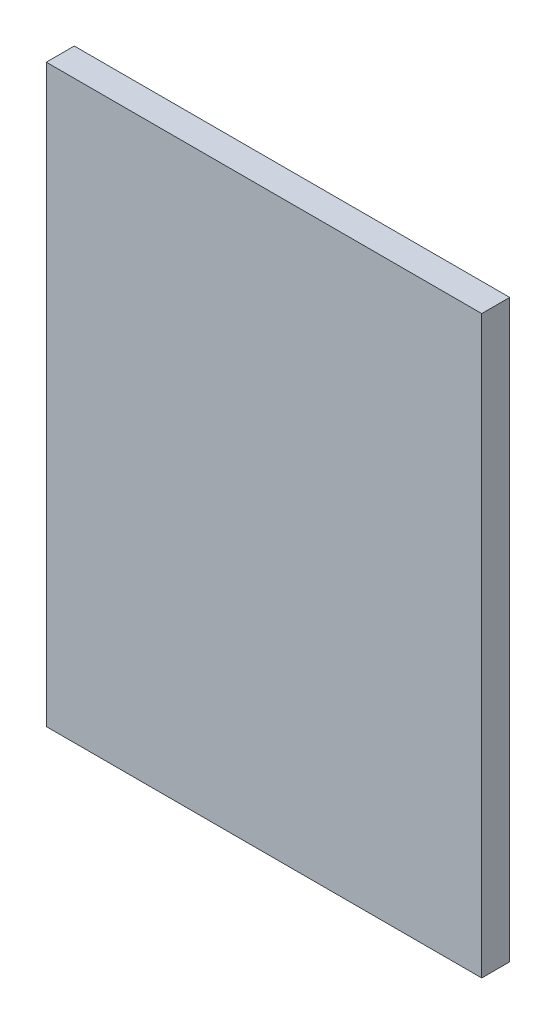
ISO-10303-21;
HEADER;
FILE_DESCRIPTION(('STEP AP214'),'2;1');
FILE_NAME('part.step','',(''),(''),'','','');
FILE_SCHEMA(('AUTOMOTIVE_DESIGN { 1 0 10303 214 1 1 1 1 }'));
ENDSEC;
DATA;
#1=APPLICATION_CONTEXT('core data for automotive mechanical design processes');
#2=APPLICATION_PROTOCOL_DEFINITION('international standard','automotive_design',2000,#1);
#3=PRODUCT_CONTEXT('',#1,'mechanical');
#4=PRODUCT('Part','Part','',(#3));
#5=PRODUCT_RELATED_PRODUCT_CATEGORY('part','',(#4));
#6=PRODUCT_DEFINITION_FORMATION('','',#4);
#7=PRODUCT_DEFINITION_CONTEXT('part definition',#1,'design');
#8=PRODUCT_DEFINITION('design','',#6,#7);
#9=PRODUCT_DEFINITION_SHAPE('','',#8);
#10=(LENGTH_UNIT() NAMED_UNIT(*) SI_UNIT(.MILLI.,.METRE.));
#11=(NAMED_UNIT(*) PLANE_ANGLE_UNIT() SI_UNIT($,.RADIAN.));
#12=(NAMED_UNIT(*) SI_UNIT($,.STERADIAN.) SOLID_ANGLE_UNIT());
#13=UNCERTAINTY_MEASURE_WITH_UNIT(LENGTH_MEASURE(1.E-05),#10,'distance_accuracy_value','');
#14=(GEOMETRIC_REPRESENTATION_CONTEXT(3) GLOBAL_UNCERTAINTY_ASSIGNED_CONTEXT((#13)) GLOBAL_UNIT_ASSIGNED_CONTEXT((#10,
#11,#12)) REPRESENTATION_CONTEXT('',''));
#15=CARTESIAN_POINT('',(0.,0.,0.));
#16=DIRECTION('',(0.,0.,1.));
#17=DIRECTION('',(1.,0.,0.));
#18=AXIS2_PLACEMENT_3D('',#15,#16,#17);
#19=CARTESIAN_POINT('',(140.,185.,18.));
#20=DIRECTION('',(-1.,0.,0.));
#21=DIRECTION('',(0.,-1.,0.));
#22=AXIS2_PLACEMENT_3D('',#19,#20,#21);
#23=PLANE('',#22);
#24=DIRECTION('',(0.,1.,0.));
#25=VECTOR('',#24,1.);
#26=CARTESIAN_POINT('',(140.,185.,0.));
#27=LINE('',#26,#25);
#28=CARTESIAN_POINT('',(140.,-185.,0.));
#29=VERTEX_POINT('',#28);
#30=CARTESIAN_POINT('',(140.,185.,0.));
#31=VERTEX_POINT('',#30);
#32=EDGE_CURVE('E96',#29,#31,#27,.T.);
#33=ORIENTED_EDGE('',*,*,#32,.T.);
#34=DIRECTION('',(0.,0.,-1.));
#35=VECTOR('',#34,1.);
#36=CARTESIAN_POINT('',(140.,185.,18.));
#37=LINE('',#36,#35);
#38=CARTESIAN_POINT('',(140.,185.,18.));
#39=VERTEX_POINT('',#38);
#40=EDGE_CURVE('E11',#39,#31,#37,.T.);
#41=ORIENTED_EDGE('',*,*,#40,.F.);
#42=DIRECTION('',(0.,1.,0.));
#43=VECTOR('',#42,1.);
#44=CARTESIAN_POINT('',(140.,185.,18.));
#45=LINE('',#44,#43);
#46=CARTESIAN_POINT('',(140.,-185.,18.));
#47=VERTEX_POINT('',#46);
#48=EDGE_CURVE('E84',#47,#39,#45,.T.);
#49=ORIENTED_EDGE('',*,*,#48,.F.);
#50=DIRECTION('',(0.,0.,-1.));
#51=VECTOR('',#50,1.);
#52=CARTESIAN_POINT('',(140.,-185.,18.));
#53=LINE('',#52,#51);
#54=EDGE_CURVE('E92',#47,#29,#53,.T.);
#55=ORIENTED_EDGE('',*,*,#54,.T.);
#56=EDGE_LOOP('',(#33,#41,#49,#55));
#57=FACE_BOUND('',#56,.T.);
#58=ADVANCED_FACE('F33',(#57),#23,.F.);
#59=CARTESIAN_POINT('',(-140.,185.,18.));
#60=DIRECTION('',(0.,-1.,0.));
#61=DIRECTION('',(0.,0.,-1.));
#62=AXIS2_PLACEMENT_3D('',#59,#60,#61);
#63=PLANE('',#62);
#64=DIRECTION('',(-1.,0.,0.));
#65=VECTOR('',#64,1.);
#66=CARTESIAN_POINT('',(-140.,185.,0.));
#67=LINE('',#66,#65);
#68=CARTESIAN_POINT('',(-140.,185.,0.));
#69=VERTEX_POINT('',#68);
#70=EDGE_CURVE('E88',#31,#69,#67,.T.);
#71=ORIENTED_EDGE('',*,*,#70,.T.);
#72=DIRECTION('',(0.,0.,-1.));
#73=VECTOR('',#72,1.);
#74=CARTESIAN_POINT('',(-140.,185.,18.));
#75=LINE('',#74,#73);
#76=CARTESIAN_POINT('',(-140.,185.,18.));
#77=VERTEX_POINT('',#76);
#78=EDGE_CURVE('E41',#77,#69,#75,.T.);
#79=ORIENTED_EDGE('',*,*,#78,.F.);
#80=DIRECTION('',(-1.,0.,0.));
#81=VECTOR('',#80,1.);
#82=CARTESIAN_POINT('',(-140.,185.,18.));
#83=LINE('',#82,#81);
#84=EDGE_CURVE('E79',#39,#77,#83,.T.);
#85=ORIENTED_EDGE('',*,*,#84,.F.);
#86=ORIENTED_EDGE('',*,*,#40,.T.);
#87=EDGE_LOOP('',(#71,#79,#85,#86));
#88=FACE_BOUND('',#87,.T.);
#89=ADVANCED_FACE('F87',(#88),#63,.F.);
#90=CARTESIAN_POINT('',(-140.,185.,18.));
#91=DIRECTION('',(1.,0.,0.));
#92=DIRECTION('',(0.,1.,0.));
#93=AXIS2_PLACEMENT_3D('',#90,#91,#92);
#94=PLANE('',#93);
#95=DIRECTION('',(0.,-1.,0.));
#96=VECTOR('',#95,1.);
#97=CARTESIAN_POINT('',(-140.,185.,0.));
#98=LINE('',#97,#96);
#99=CARTESIAN_POINT('',(-140.,-185.,0.));
#100=VERTEX_POINT('',#99);
#101=EDGE_CURVE('E66',#69,#100,#98,.T.);
#102=ORIENTED_EDGE('',*,*,#101,.T.);
#103=DIRECTION('',(0.,0.,-1.));
#104=VECTOR('',#103,1.);
#105=CARTESIAN_POINT('',(-140.,-185.,18.));
#106=LINE('',#105,#104);
#107=CARTESIAN_POINT('',(-140.,-185.,18.));
#108=VERTEX_POINT('',#107);
#109=EDGE_CURVE('E89',#108,#100,#106,.T.);
#110=ORIENTED_EDGE('',*,*,#109,.F.);
#111=DIRECTION('',(0.,-1.,0.));
#112=VECTOR('',#111,1.);
#113=CARTESIAN_POINT('',(-140.,185.,18.));
#114=LINE('',#113,#112);
#115=EDGE_CURVE('E82',#77,#108,#114,.T.);
#116=ORIENTED_EDGE('',*,*,#115,.F.);
#117=ORIENTED_EDGE('',*,*,#78,.T.);
#118=EDGE_LOOP('',(#102,#110,#116,#117));
#119=FACE_BOUND('',#118,.T.);
#120=ADVANCED_FACE('F90',(#119),#94,.F.);
#121=CARTESIAN_POINT('',(-140.,-185.,18.));
#122=DIRECTION('',(0.,1.,0.));
#123=DIRECTION('',(0.,0.,1.));
#124=AXIS2_PLACEMENT_3D('',#121,#122,#123);
#125=PLANE('',#124);
#126=DIRECTION('',(1.,0.,0.));
#127=VECTOR('',#126,1.);
#128=CARTESIAN_POINT('',(-140.,-185.,0.));
#129=LINE('',#128,#127);
#130=EDGE_CURVE('E72',#100,#29,#129,.T.);
#131=ORIENTED_EDGE('',*,*,#130,.T.);
#132=ORIENTED_EDGE('',*,*,#54,.F.);
#133=DIRECTION('',(1.,0.,0.));
#134=VECTOR('',#133,1.);
#135=CARTESIAN_POINT('',(-140.,-185.,18.));
#136=LINE('',#135,#134);
#137=EDGE_CURVE('E49',#108,#47,#136,.T.);
#138=ORIENTED_EDGE('',*,*,#137,.F.);
#139=ORIENTED_EDGE('',*,*,#109,.T.);
#140=EDGE_LOOP('',(#131,#132,#138,#139));
#141=FACE_BOUND('',#140,.T.);
#142=ADVANCED_FACE('F103',(#141),#125,.F.);
#143=CARTESIAN_POINT('',(0.,0.,18.));
#144=DIRECTION('',(0.,0.,1.));
#145=DIRECTION('',(1.,0.,0.));
#146=AXIS2_PLACEMENT_3D('',#143,#144,#145);
#147=PLANE('',#146);
#148=ORIENTED_EDGE('',*,*,#48,.T.);
#149=ORIENTED_EDGE('',*,*,#84,.T.);
#150=ORIENTED_EDGE('',*,*,#115,.T.);
#151=ORIENTED_EDGE('',*,*,#137,.T.);
#152=EDGE_LOOP('',(#148,#149,#150,#151));
#153=FACE_BOUND('',#152,.T.);
#154=ADVANCED_FACE('F80',(#153),#147,.T.);
#155=CARTESIAN_POINT('',(0.,0.,0.));
#156=DIRECTION('',(0.,0.,1.));
#157=DIRECTION('',(1.,0.,0.));
#158=AXIS2_PLACEMENT_3D('',#155,#156,#157);
#159=PLANE('',#158);
#160=ORIENTED_EDGE('',*,*,#32,.F.);
#161=ORIENTED_EDGE('',*,*,#130,.F.);
#162=ORIENTED_EDGE('',*,*,#101,.F.);
#163=ORIENTED_EDGE('',*,*,#70,.F.);
#164=EDGE_LOOP('',(#160,#161,#162,#163));
#165=FACE_BOUND('',#164,.T.);
#166=ADVANCED_FACE('F106',(#165),#159,.F.);
#167=CLOSED_SHELL('',(#58,#89,#120,#142,#154,#166));
#168=MANIFOLD_SOLID_BREP('B2',#167);
#169=ADVANCED_BREP_SHAPE_REPRESENTATION('',(#18,#168),#14);
#170=SHAPE_DEFINITION_REPRESENTATION(#9,#169);
ENDSEC;
END-ISO-10303-21;
